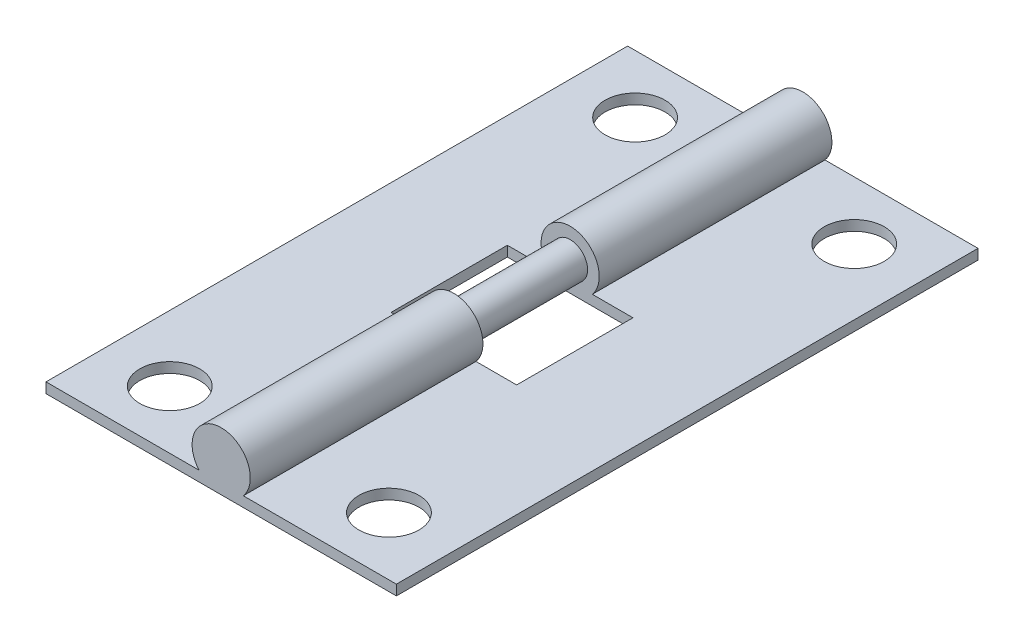
ISO-10303-21;
HEADER;
FILE_DESCRIPTION(('STEP AP214'),'2;1');
FILE_NAME('part.step','',(''),(''),'','','');
FILE_SCHEMA(('AUTOMOTIVE_DESIGN { 1 0 10303 214 1 1 1 1 }'));
ENDSEC;
DATA;
#1=APPLICATION_CONTEXT('core data for automotive mechanical design processes');
#2=APPLICATION_PROTOCOL_DEFINITION('international standard','automotive_design',2000,#1);
#3=PRODUCT_CONTEXT('',#1,'mechanical');
#4=PRODUCT('Part','Part','',(#3));
#5=PRODUCT_RELATED_PRODUCT_CATEGORY('part','',(#4));
#6=PRODUCT_DEFINITION_FORMATION('','',#4);
#7=PRODUCT_DEFINITION_CONTEXT('part definition',#1,'design');
#8=PRODUCT_DEFINITION('design','',#6,#7);
#9=PRODUCT_DEFINITION_SHAPE('','',#8);
#10=(LENGTH_UNIT() NAMED_UNIT(*) SI_UNIT(.MILLI.,.METRE.));
#11=(NAMED_UNIT(*) PLANE_ANGLE_UNIT() SI_UNIT($,.RADIAN.));
#12=(NAMED_UNIT(*) SI_UNIT($,.STERADIAN.) SOLID_ANGLE_UNIT());
#13=UNCERTAINTY_MEASURE_WITH_UNIT(LENGTH_MEASURE(1.E-05),#10,'distance_accuracy_value','');
#14=(GEOMETRIC_REPRESENTATION_CONTEXT(3) GLOBAL_UNCERTAINTY_ASSIGNED_CONTEXT((#13)) GLOBAL_UNIT_ASSIGNED_CONTEXT((#10,
#11,#12)) REPRESENTATION_CONTEXT('',''));
#15=CARTESIAN_POINT('',(0.,0.,0.));
#16=DIRECTION('',(0.,0.,1.));
#17=DIRECTION('',(1.,0.,0.));
#18=AXIS2_PLACEMENT_3D('',#15,#16,#17);
#19=CARTESIAN_POINT('',(0.,0.,31.75));
#20=DIRECTION('',(0.,1.,0.));
#21=DIRECTION('',(0.,0.,1.));
#22=AXIS2_PLACEMENT_3D('',#19,#20,#21);
#23=PLANE('',#22);
#24=CARTESIAN_POINT('',(3.5814,0.,3.175));
#25=DIRECTION('',(0.,-1.,0.));
#26=DIRECTION('',(0.,0.,-1.));
#27=AXIS2_PLACEMENT_3D('',#24,#25,#26);
#28=CIRCLE('',#27,1.6383);
#29=CARTESIAN_POINT('',(3.5814,0.,1.5367));
#30=VERTEX_POINT('',#29);
#31=EDGE_CURVE('E343',#30,#30,#28,.T.);
#32=ORIENTED_EDGE('',*,*,#31,.F.);
#33=EDGE_LOOP('',(#32));
#34=FACE_BOUND('',#33,.T.);
#35=CARTESIAN_POINT('',(15.5448,0.,3.175));
#36=DIRECTION('',(0.,-1.,0.));
#37=DIRECTION('',(0.,0.,-1.));
#38=AXIS2_PLACEMENT_3D('',#35,#36,#37);
#39=CIRCLE('',#38,1.6383);
#40=CARTESIAN_POINT('',(15.5448,0.,1.5367));
#41=VERTEX_POINT('',#40);
#42=EDGE_CURVE('E487',#41,#41,#39,.T.);
#43=ORIENTED_EDGE('',*,*,#42,.F.);
#44=EDGE_LOOP('',(#43));
#45=FACE_BOUND('',#44,.T.);
#46=CARTESIAN_POINT('',(15.5448,0.,28.575));
#47=DIRECTION('',(0.,-1.,0.));
#48=DIRECTION('',(0.,0.,-1.));
#49=AXIS2_PLACEMENT_3D('',#46,#47,#48);
#50=CIRCLE('',#49,1.6383);
#51=CARTESIAN_POINT('',(15.5448,0.,26.9367));
#52=VERTEX_POINT('',#51);
#53=EDGE_CURVE('E482',#52,#52,#50,.T.);
#54=ORIENTED_EDGE('',*,*,#53,.F.);
#55=EDGE_LOOP('',(#54));
#56=FACE_BOUND('',#55,.T.);
#57=CARTESIAN_POINT('',(3.5814,0.,28.575));
#58=DIRECTION('',(0.,-1.,0.));
#59=DIRECTION('',(0.,0.,-1.));
#60=AXIS2_PLACEMENT_3D('',#57,#58,#59);
#61=CIRCLE('',#60,1.6383);
#62=CARTESIAN_POINT('',(3.5814,0.,26.9367));
#63=VERTEX_POINT('',#62);
#64=EDGE_CURVE('E479',#63,#63,#61,.T.);
#65=ORIENTED_EDGE('',*,*,#64,.F.);
#66=EDGE_LOOP('',(#65));
#67=FACE_BOUND('',#66,.T.);
#68=DIRECTION('',(1.,0.,0.));
#69=VECTOR('',#68,1.);
#70=CARTESIAN_POINT('',(0.,0.,0.));
#71=LINE('',#70,#69);
#72=CARTESIAN_POINT('',(0.,0.,0.));
#73=VERTEX_POINT('',#72);
#74=CARTESIAN_POINT('',(19.1262,0.,0.));
#75=VERTEX_POINT('',#74);
#76=EDGE_CURVE('E203',#73,#75,#71,.T.);
#77=ORIENTED_EDGE('',*,*,#76,.T.);
#78=DIRECTION('',(0.,0.,-1.));
#79=VECTOR('',#78,1.);
#80=CARTESIAN_POINT('',(19.1262,0.,31.75));
#81=LINE('',#80,#79);
#82=CARTESIAN_POINT('',(19.1262,0.,31.75));
#83=VERTEX_POINT('',#82);
#84=EDGE_CURVE('E237',#83,#75,#81,.T.);
#85=ORIENTED_EDGE('',*,*,#84,.F.);
#86=DIRECTION('',(1.,0.,0.));
#87=VECTOR('',#86,1.);
#88=CARTESIAN_POINT('',(0.,0.,31.75));
#89=LINE('',#88,#87);
#90=CARTESIAN_POINT('',(0.,0.,31.75));
#91=VERTEX_POINT('',#90);
#92=EDGE_CURVE('E182',#91,#83,#89,.T.);
#93=ORIENTED_EDGE('',*,*,#92,.F.);
#94=DIRECTION('',(0.,0.,-1.));
#95=VECTOR('',#94,1.);
#96=CARTESIAN_POINT('',(0.,0.,31.75));
#97=LINE('',#96,#95);
#98=EDGE_CURVE('E241',#91,#73,#97,.T.);
#99=ORIENTED_EDGE('',*,*,#98,.T.);
#100=EDGE_LOOP('',(#77,#85,#93,#99));
#101=FACE_BOUND('',#100,.T.);
#102=DIRECTION('',(0.,0.,-1.));
#103=VECTOR('',#102,1.);
#104=CARTESIAN_POINT('',(12.9921,0.,0.));
#105=LINE('',#104,#103);
#106=CARTESIAN_POINT('',(12.9921,0.,19.05));
#107=VERTEX_POINT('',#106);
#108=CARTESIAN_POINT('',(12.9921,0.,12.7));
#109=VERTEX_POINT('',#108);
#110=EDGE_CURVE('E55',#107,#109,#105,.T.);
#111=ORIENTED_EDGE('',*,*,#110,.T.);
#112=DIRECTION('',(1.,0.,0.));
#113=VECTOR('',#112,1.);
#114=CARTESIAN_POINT('',(0.,0.,12.7));
#115=LINE('',#114,#113);
#116=CARTESIAN_POINT('',(6.1341,0.,12.7));
#117=VERTEX_POINT('',#116);
#118=EDGE_CURVE('E149',#117,#109,#115,.T.);
#119=ORIENTED_EDGE('',*,*,#118,.F.);
#120=DIRECTION('',(0.,0.,-1.));
#121=VECTOR('',#120,1.);
#122=CARTESIAN_POINT('',(6.1341,0.,0.));
#123=LINE('',#122,#121);
#124=CARTESIAN_POINT('',(6.1341,0.,19.05));
#125=VERTEX_POINT('',#124);
#126=EDGE_CURVE('E133',#125,#117,#123,.T.);
#127=ORIENTED_EDGE('',*,*,#126,.F.);
#128=DIRECTION('',(1.,0.,0.));
#129=VECTOR('',#128,1.);
#130=CARTESIAN_POINT('',(0.,0.,19.05));
#131=LINE('',#130,#129);
#132=EDGE_CURVE('E143',#125,#107,#131,.T.);
#133=ORIENTED_EDGE('',*,*,#132,.T.);
#134=EDGE_LOOP('',(#111,#119,#127,#133));
#135=FACE_BOUND('',#134,.T.);
#136=ADVANCED_FACE('F39',(#34,#45,#56,#67,#101,#135),#23,.F.);
#137=CARTESIAN_POINT('',(9.5631,1.5875,31.75));
#138=DIRECTION('',(0.,0.,-1.));
#139=DIRECTION('',(-1.,0.,0.));
#140=AXIS2_PLACEMENT_3D('',#137,#138,#139);
#141=CYLINDRICAL_SURFACE('',#140,1.5875);
#142=CARTESIAN_POINT('',(9.5631,1.5875,19.05));
#143=DIRECTION('',(0.,0.,-1.));
#144=DIRECTION('',(-1.,0.,0.));
#145=AXIS2_PLACEMENT_3D('',#142,#143,#144);
#146=CIRCLE('',#145,1.5875);
#147=CARTESIAN_POINT('',(8.35399596808215,0.5588,19.05));
#148=VERTEX_POINT('',#147);
#149=CARTESIAN_POINT('',(10.7722040319178,0.558799999999999,19.05));
#150=VERTEX_POINT('',#149);
#151=EDGE_CURVE('E159',#148,#150,#146,.T.);
#152=ORIENTED_EDGE('',*,*,#151,.F.);
#153=DIRECTION('',(0.,0.,-1.));
#154=VECTOR('',#153,1.);
#155=CARTESIAN_POINT('',(8.35399596808215,0.558799999999999,31.75));
#156=LINE('',#155,#154);
#157=CARTESIAN_POINT('',(8.35399596808215,0.558799999999999,31.75));
#158=VERTEX_POINT('',#157);
#159=EDGE_CURVE('E224',#158,#148,#156,.T.);
#160=ORIENTED_EDGE('',*,*,#159,.F.);
#161=CARTESIAN_POINT('',(9.5631,1.5875,31.75));
#162=DIRECTION('',(0.,0.,1.));
#163=DIRECTION('',(1.,0.,0.));
#164=AXIS2_PLACEMENT_3D('',#161,#162,#163);
#165=CIRCLE('',#164,1.5875);
#166=CARTESIAN_POINT('',(10.7722040319178,0.558799999999999,31.75));
#167=VERTEX_POINT('',#166);
#168=EDGE_CURVE('E192',#167,#158,#165,.T.);
#169=ORIENTED_EDGE('',*,*,#168,.F.);
#170=DIRECTION('',(0.,0.,-1.));
#171=VECTOR('',#170,1.);
#172=CARTESIAN_POINT('',(10.7722040319178,0.558799999999999,31.75));
#173=LINE('',#172,#171);
#174=EDGE_CURVE('E229',#167,#150,#173,.T.);
#175=ORIENTED_EDGE('',*,*,#174,.T.);
#176=EDGE_LOOP('',(#152,#160,#169,#175));
#177=FACE_BOUND('',#176,.T.);
#178=ADVANCED_FACE('F291',(#177),#141,.T.);
#179=CARTESIAN_POINT('',(0.,0.,31.75));
#180=DIRECTION('',(1.,0.,0.));
#181=DIRECTION('',(0.,0.,-1.));
#182=AXIS2_PLACEMENT_3D('',#179,#180,#181);
#183=PLANE('',#182);
#184=DIRECTION('',(0.,-1.,0.));
#185=VECTOR('',#184,1.);
#186=CARTESIAN_POINT('',(0.,0.,0.));
#187=LINE('',#186,#185);
#188=CARTESIAN_POINT('',(0.,0.5588,0.));
#189=VERTEX_POINT('',#188);
#190=EDGE_CURVE('E199',#189,#73,#187,.T.);
#191=ORIENTED_EDGE('',*,*,#190,.T.);
#192=ORIENTED_EDGE('',*,*,#98,.F.);
#193=DIRECTION('',(0.,-1.,0.));
#194=VECTOR('',#193,1.);
#195=CARTESIAN_POINT('',(0.,0.,31.75));
#196=LINE('',#195,#194);
#197=CARTESIAN_POINT('',(0.,0.5588,31.75));
#198=VERTEX_POINT('',#197);
#199=EDGE_CURVE('E178',#198,#91,#196,.T.);
#200=ORIENTED_EDGE('',*,*,#199,.F.);
#201=DIRECTION('',(0.,0.,-1.));
#202=VECTOR('',#201,1.);
#203=CARTESIAN_POINT('',(0.,0.5588,31.75));
#204=LINE('',#203,#202);
#205=EDGE_CURVE('E198',#198,#189,#204,.T.);
#206=ORIENTED_EDGE('',*,*,#205,.T.);
#207=EDGE_LOOP('',(#191,#192,#200,#206));
#208=FACE_BOUND('',#207,.T.);
#209=ADVANCED_FACE('F41',(#208),#183,.F.);
#210=CARTESIAN_POINT('',(19.1262,0.,31.75));
#211=DIRECTION('',(-1.,0.,0.));
#212=DIRECTION('',(0.,0.,1.));
#213=AXIS2_PLACEMENT_3D('',#210,#211,#212);
#214=PLANE('',#213);
#215=DIRECTION('',(0.,1.,0.));
#216=VECTOR('',#215,1.);
#217=CARTESIAN_POINT('',(19.1262,0.,0.));
#218=LINE('',#217,#216);
#219=CARTESIAN_POINT('',(19.1262,0.5588,0.));
#220=VERTEX_POINT('',#219);
#221=EDGE_CURVE('E207',#75,#220,#218,.T.);
#222=ORIENTED_EDGE('',*,*,#221,.T.);
#223=DIRECTION('',(0.,0.,-1.));
#224=VECTOR('',#223,1.);
#225=CARTESIAN_POINT('',(19.1262,0.5588,31.75));
#226=LINE('',#225,#224);
#227=CARTESIAN_POINT('',(19.1262,0.5588,31.75));
#228=VERTEX_POINT('',#227);
#229=EDGE_CURVE('E233',#228,#220,#226,.T.);
#230=ORIENTED_EDGE('',*,*,#229,.F.);
#231=DIRECTION('',(0.,1.,0.));
#232=VECTOR('',#231,1.);
#233=CARTESIAN_POINT('',(19.1262,0.,31.75));
#234=LINE('',#233,#232);
#235=EDGE_CURVE('E186',#83,#228,#234,.T.);
#236=ORIENTED_EDGE('',*,*,#235,.F.);
#237=ORIENTED_EDGE('',*,*,#84,.T.);
#238=EDGE_LOOP('',(#222,#230,#236,#237));
#239=FACE_BOUND('',#238,.T.);
#240=ADVANCED_FACE('F302',(#239),#214,.F.);
#241=CARTESIAN_POINT('',(19.1262,0.5588,31.75));
#242=DIRECTION('',(0.,-1.,0.));
#243=DIRECTION('',(1.,0.,0.));
#244=AXIS2_PLACEMENT_3D('',#241,#242,#243);
#245=PLANE('',#244);
#246=CARTESIAN_POINT('',(15.5448,0.5588,3.175));
#247=DIRECTION('',(0.,-1.,0.));
#248=DIRECTION('',(1.,0.,0.));
#249=AXIS2_PLACEMENT_3D('',#246,#247,#248);
#250=CIRCLE('',#249,1.6383);
#251=CARTESIAN_POINT('',(17.1831,0.5588,3.175));
#252=VERTEX_POINT('',#251);
#253=EDGE_CURVE('E204',#252,#252,#250,.T.);
#254=ORIENTED_EDGE('',*,*,#253,.T.);
#255=EDGE_LOOP('',(#254));
#256=FACE_BOUND('',#255,.T.);
#257=CARTESIAN_POINT('',(15.5448,0.5588,28.575));
#258=DIRECTION('',(0.,-1.,0.));
#259=DIRECTION('',(1.,0.,0.));
#260=AXIS2_PLACEMENT_3D('',#257,#258,#259);
#261=CIRCLE('',#260,1.6383);
#262=CARTESIAN_POINT('',(17.1831,0.5588,28.575));
#263=VERTEX_POINT('',#262);
#264=EDGE_CURVE('E261',#263,#263,#261,.T.);
#265=ORIENTED_EDGE('',*,*,#264,.T.);
#266=EDGE_LOOP('',(#265));
#267=FACE_BOUND('',#266,.T.);
#268=CARTESIAN_POINT('',(10.7722040319178,0.558799999999999,12.7));
#269=VERTEX_POINT('',#268);
#270=CARTESIAN_POINT('',(10.7722040319178,0.558799999999999,0.));
#271=VERTEX_POINT('',#270);
#272=EDGE_CURVE('E228',#269,#271,#173,.T.);
#273=ORIENTED_EDGE('',*,*,#272,.F.);
#274=DIRECTION('',(1.,0.,0.));
#275=VECTOR('',#274,1.);
#276=CARTESIAN_POINT('',(19.1262,0.5588,12.7));
#277=LINE('',#276,#275);
#278=CARTESIAN_POINT('',(12.9921,0.558799999999999,12.7));
#279=VERTEX_POINT('',#278);
#280=EDGE_CURVE('E173',#269,#279,#277,.T.);
#281=ORIENTED_EDGE('',*,*,#280,.T.);
#282=DIRECTION('',(0.,0.,-1.));
#283=VECTOR('',#282,1.);
#284=CARTESIAN_POINT('',(12.9921,0.558799999999999,31.75));
#285=LINE('',#284,#283);
#286=CARTESIAN_POINT('',(12.9921,0.558799999999999,19.05));
#287=VERTEX_POINT('',#286);
#288=EDGE_CURVE('E48',#287,#279,#285,.T.);
#289=ORIENTED_EDGE('',*,*,#288,.F.);
#290=DIRECTION('',(1.,0.,0.));
#291=VECTOR('',#290,1.);
#292=CARTESIAN_POINT('',(19.1262,0.5588,19.05));
#293=LINE('',#292,#291);
#294=EDGE_CURVE('E166',#150,#287,#293,.T.);
#295=ORIENTED_EDGE('',*,*,#294,.F.);
#296=ORIENTED_EDGE('',*,*,#174,.F.);
#297=DIRECTION('',(-1.,0.,0.));
#298=VECTOR('',#297,1.);
#299=CARTESIAN_POINT('',(19.1262,0.5588,31.75));
#300=LINE('',#299,#298);
#301=EDGE_CURVE('E189',#228,#167,#300,.T.);
#302=ORIENTED_EDGE('',*,*,#301,.F.);
#303=ORIENTED_EDGE('',*,*,#229,.T.);
#304=DIRECTION('',(-1.,0.,0.));
#305=VECTOR('',#304,1.);
#306=CARTESIAN_POINT('',(19.1262,0.5588,0.));
#307=LINE('',#306,#305);
#308=EDGE_CURVE('E210',#220,#271,#307,.T.);
#309=ORIENTED_EDGE('',*,*,#308,.T.);
#310=EDGE_LOOP('',(#273,#281,#289,#295,#296,#302,#303,#309));
#311=FACE_BOUND('',#310,.T.);
#312=ADVANCED_FACE('F270',(#256,#267,#311),#245,.F.);
#313=CARTESIAN_POINT('',(8.35399596808215,0.5588,12.7));
#314=VERTEX_POINT('',#313);
#315=CARTESIAN_POINT('',(8.35399596808215,0.558799999999999,0.));
#316=VERTEX_POINT('',#315);
#317=EDGE_CURVE('E223',#314,#316,#156,.T.);
#318=ORIENTED_EDGE('',*,*,#317,.F.);
#319=CARTESIAN_POINT('',(9.5631,1.5875,12.7));
#320=DIRECTION('',(0.,0.,-1.));
#321=DIRECTION('',(-1.,0.,0.));
#322=AXIS2_PLACEMENT_3D('',#319,#320,#321);
#323=CIRCLE('',#322,1.5875);
#324=EDGE_CURVE('E169',#314,#269,#323,.T.);
#325=ORIENTED_EDGE('',*,*,#324,.T.);
#326=ORIENTED_EDGE('',*,*,#272,.T.);
#327=CARTESIAN_POINT('',(9.5631,1.5875,0.));
#328=DIRECTION('',(0.,0.,1.));
#329=DIRECTION('',(1.,0.,0.));
#330=AXIS2_PLACEMENT_3D('',#327,#328,#329);
#331=CIRCLE('',#330,1.5875);
#332=EDGE_CURVE('E214',#271,#316,#331,.T.);
#333=ORIENTED_EDGE('',*,*,#332,.T.);
#334=EDGE_LOOP('',(#318,#325,#326,#333));
#335=FACE_BOUND('',#334,.T.);
#336=ADVANCED_FACE('F298',(#335),#141,.T.);
#337=CARTESIAN_POINT('',(0.,0.5588,31.75));
#338=DIRECTION('',(0.,-1.,0.));
#339=DIRECTION('',(0.,0.,-1.));
#340=AXIS2_PLACEMENT_3D('',#337,#338,#339);
#341=PLANE('',#340);
#342=CARTESIAN_POINT('',(3.5814,0.5588,3.175));
#343=DIRECTION('',(0.,-1.,0.));
#344=DIRECTION('',(0.,0.,-1.));
#345=AXIS2_PLACEMENT_3D('',#342,#343,#344);
#346=CIRCLE('',#345,1.6383);
#347=CARTESIAN_POINT('',(3.5814,0.5588,1.5367));
#348=VERTEX_POINT('',#347);
#349=EDGE_CURVE('E257',#348,#348,#346,.T.);
#350=ORIENTED_EDGE('',*,*,#349,.T.);
#351=EDGE_LOOP('',(#350));
#352=FACE_BOUND('',#351,.T.);
#353=CARTESIAN_POINT('',(3.5814,0.5588,28.575));
#354=DIRECTION('',(0.,-1.,0.));
#355=DIRECTION('',(0.,0.,-1.));
#356=AXIS2_PLACEMENT_3D('',#353,#354,#355);
#357=CIRCLE('',#356,1.6383);
#358=CARTESIAN_POINT('',(3.5814,0.5588,26.9367));
#359=VERTEX_POINT('',#358);
#360=EDGE_CURVE('E177',#359,#359,#357,.T.);
#361=ORIENTED_EDGE('',*,*,#360,.T.);
#362=EDGE_LOOP('',(#361));
#363=FACE_BOUND('',#362,.T.);
#364=DIRECTION('',(0.,0.,-1.));
#365=VECTOR('',#364,1.);
#366=CARTESIAN_POINT('',(6.1341,0.5588,31.75));
#367=LINE('',#366,#365);
#368=CARTESIAN_POINT('',(6.1341,0.5588,19.05));
#369=VERTEX_POINT('',#368);
#370=CARTESIAN_POINT('',(6.1341,0.5588,12.7));
#371=VERTEX_POINT('',#370);
#372=EDGE_CURVE('E136',#369,#371,#367,.T.);
#373=ORIENTED_EDGE('',*,*,#372,.T.);
#374=DIRECTION('',(1.,0.,0.));
#375=VECTOR('',#374,1.);
#376=CARTESIAN_POINT('',(0.,0.5588,12.7));
#377=LINE('',#376,#375);
#378=EDGE_CURVE('E250',#371,#314,#377,.T.);
#379=ORIENTED_EDGE('',*,*,#378,.T.);
#380=ORIENTED_EDGE('',*,*,#317,.T.);
#381=DIRECTION('',(-1.,0.,0.));
#382=VECTOR('',#381,1.);
#383=CARTESIAN_POINT('',(0.,0.5588,0.));
#384=LINE('',#383,#382);
#385=EDGE_CURVE('E183',#316,#189,#384,.T.);
#386=ORIENTED_EDGE('',*,*,#385,.T.);
#387=ORIENTED_EDGE('',*,*,#205,.F.);
#388=DIRECTION('',(-1.,0.,0.));
#389=VECTOR('',#388,1.);
#390=CARTESIAN_POINT('',(0.,0.5588,31.75));
#391=LINE('',#390,#389);
#392=EDGE_CURVE('E195',#158,#198,#391,.T.);
#393=ORIENTED_EDGE('',*,*,#392,.F.);
#394=ORIENTED_EDGE('',*,*,#159,.T.);
#395=DIRECTION('',(1.,0.,0.));
#396=VECTOR('',#395,1.);
#397=CARTESIAN_POINT('',(0.,0.5588,19.05));
#398=LINE('',#397,#396);
#399=EDGE_CURVE('E245',#369,#148,#398,.T.);
#400=ORIENTED_EDGE('',*,*,#399,.F.);
#401=EDGE_LOOP('',(#373,#379,#380,#386,#387,#393,#394,#400));
#402=FACE_BOUND('',#401,.T.);
#403=ADVANCED_FACE('F309',(#352,#363,#402),#341,.F.);
#404=CARTESIAN_POINT('',(9.5631,1.5875,31.75));
#405=DIRECTION('',(0.,0.,1.));
#406=DIRECTION('',(1.,0.,0.));
#407=AXIS2_PLACEMENT_3D('',#404,#405,#406);
#408=PLANE('',#407);
#409=ORIENTED_EDGE('',*,*,#199,.T.);
#410=ORIENTED_EDGE('',*,*,#92,.T.);
#411=ORIENTED_EDGE('',*,*,#235,.T.);
#412=ORIENTED_EDGE('',*,*,#301,.T.);
#413=ORIENTED_EDGE('',*,*,#168,.T.);
#414=ORIENTED_EDGE('',*,*,#392,.T.);
#415=EDGE_LOOP('',(#409,#410,#411,#412,#413,#414));
#416=FACE_BOUND('',#415,.T.);
#417=ADVANCED_FACE('F313',(#416),#408,.T.);
#418=CARTESIAN_POINT('',(9.5631,1.5875,0.));
#419=DIRECTION('',(0.,0.,1.));
#420=DIRECTION('',(1.,0.,0.));
#421=AXIS2_PLACEMENT_3D('',#418,#419,#420);
#422=PLANE('',#421);
#423=ORIENTED_EDGE('',*,*,#190,.F.);
#424=ORIENTED_EDGE('',*,*,#385,.F.);
#425=ORIENTED_EDGE('',*,*,#332,.F.);
#426=ORIENTED_EDGE('',*,*,#308,.F.);
#427=ORIENTED_EDGE('',*,*,#221,.F.);
#428=ORIENTED_EDGE('',*,*,#76,.F.);
#429=EDGE_LOOP('',(#423,#424,#425,#426,#427,#428));
#430=FACE_BOUND('',#429,.T.);
#431=ADVANCED_FACE('F315',(#430),#422,.F.);
#432=CARTESIAN_POINT('',(12.9921,3.175,0.));
#433=DIRECTION('',(-1.,0.,0.));
#434=DIRECTION('',(0.,0.,1.));
#435=AXIS2_PLACEMENT_3D('',#432,#433,#434);
#436=PLANE('',#435);
#437=ORIENTED_EDGE('',*,*,#288,.T.);
#438=DIRECTION('',(0.,-1.,0.));
#439=VECTOR('',#438,1.);
#440=CARTESIAN_POINT('',(12.9921,3.175,12.7));
#441=LINE('',#440,#439);
#442=EDGE_CURVE('E156',#279,#109,#441,.T.);
#443=ORIENTED_EDGE('',*,*,#442,.T.);
#444=ORIENTED_EDGE('',*,*,#110,.F.);
#445=DIRECTION('',(0.,-1.,0.));
#446=VECTOR('',#445,1.);
#447=CARTESIAN_POINT('',(12.9921,3.175,19.05));
#448=LINE('',#447,#446);
#449=EDGE_CURVE('E140',#287,#107,#448,.T.);
#450=ORIENTED_EDGE('',*,*,#449,.F.);
#451=EDGE_LOOP('',(#437,#443,#444,#450));
#452=FACE_BOUND('',#451,.T.);
#453=ADVANCED_FACE('F318',(#452),#436,.T.);
#454=CARTESIAN_POINT('',(0.,3.175,12.7));
#455=DIRECTION('',(0.,0.,-1.));
#456=DIRECTION('',(-1.,0.,0.));
#457=AXIS2_PLACEMENT_3D('',#454,#455,#456);
#458=PLANE('',#457);
#459=CARTESIAN_POINT('',(9.5631,1.5875,12.7));
#460=DIRECTION('',(0.,0.,-1.));
#461=DIRECTION('',(-1.,0.,0.));
#462=AXIS2_PLACEMENT_3D('',#459,#460,#461);
#463=CIRCLE('',#462,0.9525);
#464=CARTESIAN_POINT('',(8.6106,1.5875,12.7));
#465=VERTEX_POINT('',#464);
#466=EDGE_CURVE('E11',#465,#465,#463,.F.);
#467=ORIENTED_EDGE('',*,*,#466,.F.);
#468=EDGE_LOOP('',(#467));
#469=FACE_BOUND('',#468,.T.);
#470=ORIENTED_EDGE('',*,*,#324,.F.);
#471=ORIENTED_EDGE('',*,*,#378,.F.);
#472=DIRECTION('',(0.,-1.,0.));
#473=VECTOR('',#472,1.);
#474=CARTESIAN_POINT('',(6.1341,3.175,12.7));
#475=LINE('',#474,#473);
#476=EDGE_CURVE('E139',#371,#117,#475,.T.);
#477=ORIENTED_EDGE('',*,*,#476,.T.);
#478=ORIENTED_EDGE('',*,*,#118,.T.);
#479=ORIENTED_EDGE('',*,*,#442,.F.);
#480=ORIENTED_EDGE('',*,*,#280,.F.);
#481=EDGE_LOOP('',(#470,#471,#477,#478,#479,#480));
#482=FACE_BOUND('',#481,.T.);
#483=ADVANCED_FACE('F325',(#469,#482),#458,.F.);
#484=CARTESIAN_POINT('',(6.1341,3.175,0.));
#485=DIRECTION('',(-1.,0.,0.));
#486=DIRECTION('',(0.,0.,1.));
#487=AXIS2_PLACEMENT_3D('',#484,#485,#486);
#488=PLANE('',#487);
#489=DIRECTION('',(0.,-1.,0.));
#490=VECTOR('',#489,1.);
#491=CARTESIAN_POINT('',(6.1341,3.175,19.05));
#492=LINE('',#491,#490);
#493=EDGE_CURVE('E63',#369,#125,#492,.T.);
#494=ORIENTED_EDGE('',*,*,#493,.T.);
#495=ORIENTED_EDGE('',*,*,#126,.T.);
#496=ORIENTED_EDGE('',*,*,#476,.F.);
#497=ORIENTED_EDGE('',*,*,#372,.F.);
#498=EDGE_LOOP('',(#494,#495,#496,#497));
#499=FACE_BOUND('',#498,.T.);
#500=ADVANCED_FACE('F130',(#499),#488,.F.);
#501=CARTESIAN_POINT('',(0.,3.175,19.05));
#502=DIRECTION('',(0.,0.,-1.));
#503=DIRECTION('',(-1.,0.,0.));
#504=AXIS2_PLACEMENT_3D('',#501,#502,#503);
#505=PLANE('',#504);
#506=CARTESIAN_POINT('',(9.5631,1.5875,19.05));
#507=DIRECTION('',(0.,0.,-1.));
#508=DIRECTION('',(-1.,0.,0.));
#509=AXIS2_PLACEMENT_3D('',#506,#507,#508);
#510=CIRCLE('',#509,0.9525);
#511=CARTESIAN_POINT('',(8.6106,1.5875,19.05));
#512=VERTEX_POINT('',#511);
#513=EDGE_CURVE('E488',#512,#512,#510,.T.);
#514=ORIENTED_EDGE('',*,*,#513,.F.);
#515=EDGE_LOOP('',(#514));
#516=FACE_BOUND('',#515,.T.);
#517=ORIENTED_EDGE('',*,*,#294,.T.);
#518=ORIENTED_EDGE('',*,*,#449,.T.);
#519=ORIENTED_EDGE('',*,*,#132,.F.);
#520=ORIENTED_EDGE('',*,*,#493,.F.);
#521=ORIENTED_EDGE('',*,*,#399,.T.);
#522=ORIENTED_EDGE('',*,*,#151,.T.);
#523=EDGE_LOOP('',(#517,#518,#519,#520,#521,#522));
#524=FACE_BOUND('',#523,.T.);
#525=ADVANCED_FACE('F144',(#516,#524),#505,.T.);
#526=CARTESIAN_POINT('',(3.5814,3.175,28.575));
#527=DIRECTION('',(0.,-1.,0.));
#528=DIRECTION('',(0.,0.,-1.));
#529=AXIS2_PLACEMENT_3D('',#526,#527,#528);
#530=CYLINDRICAL_SURFACE('',#529,1.6383);
#531=ORIENTED_EDGE('',*,*,#64,.T.);
#532=EDGE_LOOP('',(#531));
#533=FACE_BOUND('',#532,.T.);
#534=ORIENTED_EDGE('',*,*,#360,.F.);
#535=EDGE_LOOP('',(#534));
#536=FACE_BOUND('',#535,.T.);
#537=ADVANCED_FACE('F328',(#533,#536),#530,.F.);
#538=CARTESIAN_POINT('',(3.5814,3.175,3.175));
#539=DIRECTION('',(0.,-1.,0.));
#540=DIRECTION('',(0.,0.,-1.));
#541=AXIS2_PLACEMENT_3D('',#538,#539,#540);
#542=CYLINDRICAL_SURFACE('',#541,1.6383);
#543=ORIENTED_EDGE('',*,*,#31,.T.);
#544=EDGE_LOOP('',(#543));
#545=FACE_BOUND('',#544,.T.);
#546=ORIENTED_EDGE('',*,*,#349,.F.);
#547=EDGE_LOOP('',(#546));
#548=FACE_BOUND('',#547,.T.);
#549=ADVANCED_FACE('F285',(#545,#548),#542,.F.);
#550=CARTESIAN_POINT('',(15.5448,3.175,28.575));
#551=DIRECTION('',(0.,-1.,0.));
#552=DIRECTION('',(0.,0.,-1.));
#553=AXIS2_PLACEMENT_3D('',#550,#551,#552);
#554=CYLINDRICAL_SURFACE('',#553,1.6383);
#555=ORIENTED_EDGE('',*,*,#53,.T.);
#556=EDGE_LOOP('',(#555));
#557=FACE_BOUND('',#556,.T.);
#558=ORIENTED_EDGE('',*,*,#264,.F.);
#559=EDGE_LOOP('',(#558));
#560=FACE_BOUND('',#559,.T.);
#561=ADVANCED_FACE('F276',(#557,#560),#554,.F.);
#562=CARTESIAN_POINT('',(15.5448,3.175,3.175));
#563=DIRECTION('',(0.,-1.,0.));
#564=DIRECTION('',(0.,0.,-1.));
#565=AXIS2_PLACEMENT_3D('',#562,#563,#564);
#566=CYLINDRICAL_SURFACE('',#565,1.6383);
#567=ORIENTED_EDGE('',*,*,#42,.T.);
#568=EDGE_LOOP('',(#567));
#569=FACE_BOUND('',#568,.T.);
#570=ORIENTED_EDGE('',*,*,#253,.F.);
#571=EDGE_LOOP('',(#570));
#572=FACE_BOUND('',#571,.T.);
#573=ADVANCED_FACE('F273',(#569,#572),#566,.F.);
#574=CARTESIAN_POINT('',(9.5631,1.5875,31.752));
#575=DIRECTION('',(0.,0.,-1.));
#576=DIRECTION('',(-1.,0.,0.));
#577=AXIS2_PLACEMENT_3D('',#574,#575,#576);
#578=CYLINDRICAL_SURFACE('',#577,0.9525);
#579=ORIENTED_EDGE('',*,*,#513,.T.);
#580=EDGE_LOOP('',(#579));
#581=FACE_BOUND('',#580,.T.);
#582=ORIENTED_EDGE('',*,*,#466,.T.);
#583=EDGE_LOOP('',(#582));
#584=FACE_BOUND('',#583,.T.);
#585=ADVANCED_FACE('F275',(#581,#584),#578,.T.);
#586=CLOSED_SHELL('',(#136,#178,#209,#240,#312,#336,#403,#417,#431,#453,#483,#500,#525,#537,
#549,#561,#573,#585));
#587=MANIFOLD_SOLID_BREP('B2',#586);
#588=ADVANCED_BREP_SHAPE_REPRESENTATION('',(#18,#587),#14);
#589=SHAPE_DEFINITION_REPRESENTATION(#9,#588);
ENDSEC;
END-ISO-10303-21;
